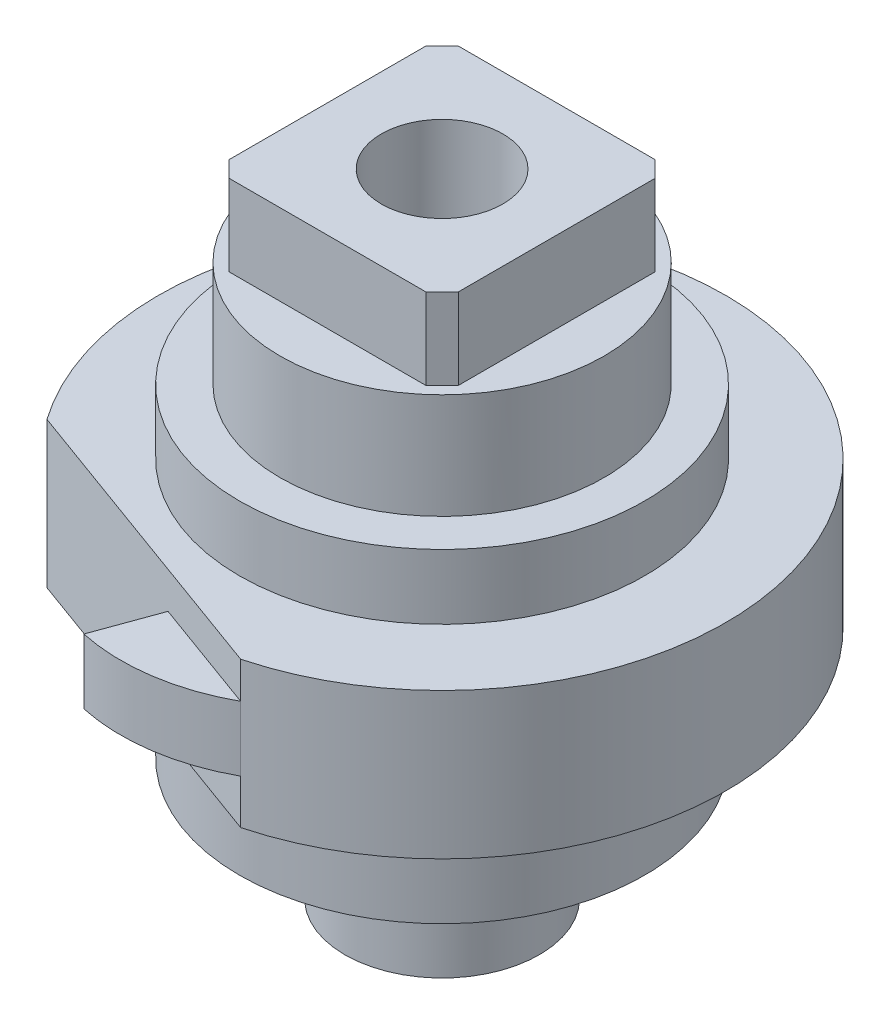
ISO-10303-21;
HEADER;
FILE_DESCRIPTION(('STEP AP214'),'2;1');
FILE_NAME('part.step','',(''),(''),'','','');
FILE_SCHEMA(('AUTOMOTIVE_DESIGN { 1 0 10303 214 1 1 1 1 }'));
ENDSEC;
DATA;
#1=APPLICATION_CONTEXT('core data for automotive mechanical design processes');
#2=APPLICATION_PROTOCOL_DEFINITION('international standard','automotive_design',2000,#1);
#3=PRODUCT_CONTEXT('',#1,'mechanical');
#4=PRODUCT('Part','Part','',(#3));
#5=PRODUCT_RELATED_PRODUCT_CATEGORY('part','',(#4));
#6=PRODUCT_DEFINITION_FORMATION('','',#4);
#7=PRODUCT_DEFINITION_CONTEXT('part definition',#1,'design');
#8=PRODUCT_DEFINITION('design','',#6,#7);
#9=PRODUCT_DEFINITION_SHAPE('','',#8);
#10=(LENGTH_UNIT() NAMED_UNIT(*) SI_UNIT(.MILLI.,.METRE.));
#11=(NAMED_UNIT(*) PLANE_ANGLE_UNIT() SI_UNIT($,.RADIAN.));
#12=(NAMED_UNIT(*) SI_UNIT($,.STERADIAN.) SOLID_ANGLE_UNIT());
#13=UNCERTAINTY_MEASURE_WITH_UNIT(LENGTH_MEASURE(1.E-05),#10,'distance_accuracy_value','');
#14=(GEOMETRIC_REPRESENTATION_CONTEXT(3) GLOBAL_UNCERTAINTY_ASSIGNED_CONTEXT((#13)) GLOBAL_UNIT_ASSIGNED_CONTEXT((#10,
#11,#12)) REPRESENTATION_CONTEXT('',''));
#15=CARTESIAN_POINT('',(0.,0.,0.));
#16=DIRECTION('',(0.,0.,1.));
#17=DIRECTION('',(1.,0.,0.));
#18=AXIS2_PLACEMENT_3D('',#15,#16,#17);
#19=CARTESIAN_POINT('',(0.,0.65,0.));
#20=DIRECTION('',(0.,1.,0.));
#21=DIRECTION('',(0.,0.,1.));
#22=AXIS2_PLACEMENT_3D('',#19,#20,#21);
#23=PLANE('',#22);
#24=CARTESIAN_POINT('',(0.,0.65,0.));
#25=DIRECTION('',(0.,1.,0.));
#26=DIRECTION('',(0.,0.,1.));
#27=AXIS2_PLACEMENT_3D('',#24,#25,#26);
#28=CIRCLE('',#27,1.);
#29=CARTESIAN_POINT('',(-0.707106781186547,0.65,0.707106781186548));
#30=VERTEX_POINT('',#29);
#31=CARTESIAN_POINT('',(0.707106781186548,0.65,0.707106781186547));
#32=VERTEX_POINT('',#31);
#33=EDGE_CURVE('E239',#30,#32,#28,.T.);
#34=ORIENTED_EDGE('',*,*,#33,.T.);
#35=CARTESIAN_POINT('',(0.707106781186548,0.65,-0.707106781186547));
#36=VERTEX_POINT('',#35);
#37=EDGE_CURVE('E252',#32,#36,#28,.T.);
#38=ORIENTED_EDGE('',*,*,#37,.T.);
#39=CARTESIAN_POINT('',(-0.707106781186548,0.65,-0.707106781186547));
#40=VERTEX_POINT('',#39);
#41=EDGE_CURVE('E254',#36,#40,#28,.T.);
#42=ORIENTED_EDGE('',*,*,#41,.T.);
#43=EDGE_CURVE('E593',#40,#30,#28,.T.);
#44=ORIENTED_EDGE('',*,*,#43,.T.);
#45=EDGE_LOOP('',(#34,#38,#42,#44));
#46=FACE_BOUND('',#45,.T.);
#47=DIRECTION('',(1.,0.,0.));
#48=VECTOR('',#47,1.);
#49=CARTESIAN_POINT('',(0.707106781186548,0.65,0.707106781186548));
#50=LINE('',#49,#48);
#51=CARTESIAN_POINT('',(-0.607106781186548,0.65,0.707106781186548));
#52=VERTEX_POINT('',#51);
#53=CARTESIAN_POINT('',(0.607106781186548,0.65,0.707106781186548));
#54=VERTEX_POINT('',#53);
#55=EDGE_CURVE('E47',#52,#54,#50,.T.);
#56=ORIENTED_EDGE('',*,*,#55,.F.);
#57=DIRECTION('',(0.707106781186544,0.,0.707106781186551));
#58=VECTOR('',#57,1.);
#59=CARTESIAN_POINT('',(-0.607106781186548,0.65,0.707106781186548));
#60=LINE('',#59,#58);
#61=CARTESIAN_POINT('',(-0.707106781186547,0.65,0.607106781186548));
#62=VERTEX_POINT('',#61);
#63=EDGE_CURVE('E40',#52,#62,#60,.F.);
#64=ORIENTED_EDGE('',*,*,#63,.T.);
#65=DIRECTION('',(0.,0.,1.));
#66=VECTOR('',#65,1.);
#67=CARTESIAN_POINT('',(-0.707106781186547,0.65,0.707106781186548));
#68=LINE('',#67,#66);
#69=CARTESIAN_POINT('',(-0.707106781186548,0.65,-0.607106781186548));
#70=VERTEX_POINT('',#69);
#71=EDGE_CURVE('E54',#70,#62,#68,.T.);
#72=ORIENTED_EDGE('',*,*,#71,.F.);
#73=DIRECTION('',(-0.707106781186551,0.,0.707106781186544));
#74=VECTOR('',#73,1.);
#75=CARTESIAN_POINT('',(-0.707106781186548,0.65,-0.607106781186548));
#76=LINE('',#75,#74);
#77=CARTESIAN_POINT('',(-0.607106781186547,0.65,-0.707106781186547));
#78=VERTEX_POINT('',#77);
#79=EDGE_CURVE('E215',#70,#78,#76,.F.);
#80=ORIENTED_EDGE('',*,*,#79,.T.);
#81=DIRECTION('',(-1.,0.,0.));
#82=VECTOR('',#81,1.);
#83=CARTESIAN_POINT('',(-0.707106781186548,0.65,-0.707106781186547));
#84=LINE('',#83,#82);
#85=CARTESIAN_POINT('',(0.607106781186549,0.65,-0.707106781186547));
#86=VERTEX_POINT('',#85);
#87=EDGE_CURVE('E248',#86,#78,#84,.T.);
#88=ORIENTED_EDGE('',*,*,#87,.F.);
#89=DIRECTION('',(-0.707106781186541,0.,-0.707106781186554));
#90=VECTOR('',#89,1.);
#91=CARTESIAN_POINT('',(0.607106781186549,0.65,-0.707106781186547));
#92=LINE('',#91,#90);
#93=CARTESIAN_POINT('',(0.707106781186548,0.65,-0.607106781186547));
#94=VERTEX_POINT('',#93);
#95=EDGE_CURVE('E212',#86,#94,#92,.F.);
#96=ORIENTED_EDGE('',*,*,#95,.T.);
#97=DIRECTION('',(0.,0.,-1.));
#98=VECTOR('',#97,1.);
#99=CARTESIAN_POINT('',(0.707106781186548,0.65,-0.707106781186547));
#100=LINE('',#99,#98);
#101=CARTESIAN_POINT('',(0.707106781186548,0.65,0.607106781186549));
#102=VERTEX_POINT('',#101);
#103=EDGE_CURVE('E246',#102,#94,#100,.T.);
#104=ORIENTED_EDGE('',*,*,#103,.F.);
#105=DIRECTION('',(0.707106781186554,0.,-0.707106781186541));
#106=VECTOR('',#105,1.);
#107=CARTESIAN_POINT('',(0.707106781186548,0.65,0.607106781186549));
#108=LINE('',#107,#106);
#109=EDGE_CURVE('E11',#102,#54,#108,.F.);
#110=ORIENTED_EDGE('',*,*,#109,.T.);
#111=EDGE_LOOP('',(#56,#64,#72,#80,#88,#96,#104,#110));
#112=FACE_BOUND('',#111,.T.);
#113=ADVANCED_FACE('F32',(#46,#112),#23,.T.);
#114=CARTESIAN_POINT('',(0.,0.,0.));
#115=DIRECTION('',(0.,1.,0.));
#116=DIRECTION('',(0.,0.,1.));
#117=AXIS2_PLACEMENT_3D('',#114,#115,#116);
#118=PLANE('',#117);
#119=CARTESIAN_POINT('',(0.,0.,0.));
#120=DIRECTION('',(0.,1.,0.));
#121=DIRECTION('',(0.,0.,1.));
#122=AXIS2_PLACEMENT_3D('',#119,#120,#121);
#123=CIRCLE('',#122,1.25);
#124=CARTESIAN_POINT('',(0.,0.,1.25));
#125=VERTEX_POINT('',#124);
#126=EDGE_CURVE('E253',#125,#125,#123,.T.);
#127=ORIENTED_EDGE('',*,*,#126,.T.);
#128=EDGE_LOOP('',(#127));
#129=FACE_BOUND('',#128,.T.);
#130=CARTESIAN_POINT('',(0.,0.,0.));
#131=DIRECTION('',(0.,1.,0.));
#132=DIRECTION('',(0.,0.,1.));
#133=AXIS2_PLACEMENT_3D('',#130,#131,#132);
#134=CIRCLE('',#133,1.);
#135=CARTESIAN_POINT('',(0.,0.,1.));
#136=VERTEX_POINT('',#135);
#137=EDGE_CURVE('E235',#136,#136,#134,.T.);
#138=ORIENTED_EDGE('',*,*,#137,.F.);
#139=EDGE_LOOP('',(#138));
#140=FACE_BOUND('',#139,.T.);
#141=ADVANCED_FACE('F303',(#129,#140),#118,.T.);
#142=CARTESIAN_POINT('',(0.,-0.400000000000004,0.));
#143=DIRECTION('',(0.,-1.,0.));
#144=DIRECTION('',(0.,0.,-1.));
#145=AXIS2_PLACEMENT_3D('',#142,#143,#144);
#146=PLANE('',#145);
#147=CARTESIAN_POINT('',(0.,-0.400000000000004,0.));
#148=DIRECTION('',(0.,-1.,0.));
#149=DIRECTION('',(0.,0.,-1.));
#150=AXIS2_PLACEMENT_3D('',#147,#148,#149);
#151=CIRCLE('',#150,1.75);
#152=CARTESIAN_POINT('',(-1.43088165571397,-0.400000000000004,1.00751063882286));
#153=VERTEX_POINT('',#152);
#154=CARTESIAN_POINT('',(0.44850358585784,-0.400000000000004,1.69155092547421));
#155=VERTEX_POINT('',#154);
#156=EDGE_CURVE('E258',#153,#155,#151,.T.);
#157=ORIENTED_EDGE('',*,*,#156,.F.);
#158=DIRECTION('',(-0.939692620785906,0.,-0.342020143325676));
#159=VECTOR('',#158,1.);
#160=CARTESIAN_POINT('',(0.44850358585784,-0.400000000000004,1.69155092547421));
#161=LINE('',#160,#159);
#162=EDGE_CURVE('E261',#155,#153,#161,.T.);
#163=ORIENTED_EDGE('',*,*,#162,.F.);
#164=EDGE_LOOP('',(#157,#163));
#165=FACE_BOUND('',#164,.T.);
#166=CARTESIAN_POINT('',(0.,-0.400000000000004,0.));
#167=DIRECTION('',(0.,-1.,0.));
#168=DIRECTION('',(0.,0.,-1.));
#169=AXIS2_PLACEMENT_3D('',#166,#167,#168);
#170=CIRCLE('',#169,1.25);
#171=CARTESIAN_POINT('',(0.,-0.400000000000004,-1.25));
#172=VERTEX_POINT('',#171);
#173=EDGE_CURVE('E175',#172,#172,#170,.F.);
#174=ORIENTED_EDGE('',*,*,#173,.F.);
#175=EDGE_LOOP('',(#174));
#176=FACE_BOUND('',#175,.T.);
#177=ADVANCED_FACE('F309',(#165,#176),#146,.F.);
#178=CARTESIAN_POINT('',(0.,-0.400000000000004,0.));
#179=DIRECTION('',(0.,-1.,0.));
#180=DIRECTION('',(0.,0.,-1.));
#181=AXIS2_PLACEMENT_3D('',#178,#179,#180);
#182=CYLINDRICAL_SURFACE('',#181,1.75);
#183=DIRECTION('',(0.,-1.,0.));
#184=VECTOR('',#183,1.);
#185=CARTESIAN_POINT('',(0.44850358585784,-0.625000000000017,1.69155092547421));
#186=LINE('',#185,#184);
#187=CARTESIAN_POINT('',(0.44850358585784,-0.625000000000017,1.69155092547421));
#188=VERTEX_POINT('',#187);
#189=CARTESIAN_POINT('',(0.44850358585784,-1.02500000000002,1.69155092547421));
#190=VERTEX_POINT('',#189);
#191=EDGE_CURVE('E160',#188,#190,#186,.T.);
#192=ORIENTED_EDGE('',*,*,#191,.T.);
#193=DIRECTION('',(0.,1.,0.));
#194=VECTOR('',#193,1.);
#195=CARTESIAN_POINT('',(0.44850358585784,-1.3,1.69155092547421));
#196=LINE('',#195,#194);
#197=CARTESIAN_POINT('',(0.44850358585784,-1.3,1.69155092547421));
#198=VERTEX_POINT('',#197);
#199=EDGE_CURVE('E146',#198,#190,#196,.T.);
#200=ORIENTED_EDGE('',*,*,#199,.F.);
#201=CARTESIAN_POINT('',(0.,-1.3,0.));
#202=DIRECTION('',(0.,-1.,0.));
#203=DIRECTION('',(0.,0.,1.));
#204=AXIS2_PLACEMENT_3D('',#201,#202,#203);
#205=CIRCLE('',#204,1.75);
#206=CARTESIAN_POINT('',(-1.43088165571397,-1.3,1.00751063882286));
#207=VERTEX_POINT('',#206);
#208=EDGE_CURVE('E151',#207,#198,#205,.T.);
#209=ORIENTED_EDGE('',*,*,#208,.F.);
#210=DIRECTION('',(0.,-1.,0.));
#211=VECTOR('',#210,1.);
#212=CARTESIAN_POINT('',(-1.43088165571397,-0.400000000000004,1.00751063882286));
#213=LINE('',#212,#211);
#214=EDGE_CURVE('E148',#153,#207,#213,.T.);
#215=ORIENTED_EDGE('',*,*,#214,.F.);
#216=ORIENTED_EDGE('',*,*,#156,.T.);
#217=DIRECTION('',(0.,-1.,0.));
#218=VECTOR('',#217,1.);
#219=CARTESIAN_POINT('',(0.44850358585784,-0.400000000000004,1.69155092547421));
#220=LINE('',#219,#218);
#221=EDGE_CURVE('E263',#155,#188,#220,.T.);
#222=ORIENTED_EDGE('',*,*,#221,.T.);
#223=EDGE_LOOP('',(#192,#200,#209,#215,#216,#222));
#224=FACE_BOUND('',#223,.T.);
#225=ADVANCED_FACE('F158',(#224),#182,.T.);
#226=CARTESIAN_POINT('',(0.44850358585784,-0.400000000000004,1.69155092547421));
#227=DIRECTION('',(-0.342020143325675,0.,0.939692620785906));
#228=DIRECTION('',(0.939692620785906,0.,0.342020143325676));
#229=AXIS2_PLACEMENT_3D('',#226,#227,#228);
#230=PLANE('',#229);
#231=DIRECTION('',(0.,-1.,0.));
#232=VECTOR('',#231,1.);
#233=CARTESIAN_POINT('',(-0.256265879731589,-0.625000000000017,1.43503581797995));
#234=LINE('',#233,#232);
#235=CARTESIAN_POINT('',(-0.256265879731589,-0.625000000000017,1.43503581797995));
#236=VERTEX_POINT('',#235);
#237=CARTESIAN_POINT('',(-0.256265879731589,-1.02500000000002,1.43503581797995));
#238=VERTEX_POINT('',#237);
#239=EDGE_CURVE('E180',#236,#238,#234,.T.);
#240=ORIENTED_EDGE('',*,*,#239,.F.);
#241=DIRECTION('',(0.939692620785906,0.,0.342020143325676));
#242=VECTOR('',#241,1.);
#243=CARTESIAN_POINT('',(-0.256265879731589,-0.625000000000017,1.43503581797995));
#244=LINE('',#243,#242);
#245=EDGE_CURVE('E268',#236,#188,#244,.T.);
#246=ORIENTED_EDGE('',*,*,#245,.T.);
#247=ORIENTED_EDGE('',*,*,#221,.F.);
#248=ORIENTED_EDGE('',*,*,#162,.T.);
#249=ORIENTED_EDGE('',*,*,#214,.T.);
#250=DIRECTION('',(-0.939692620785906,0.,-0.342020143325676));
#251=VECTOR('',#250,1.);
#252=CARTESIAN_POINT('',(-1.43088165571397,-1.3,1.00751063882286));
#253=LINE('',#252,#251);
#254=EDGE_CURVE('E140',#198,#207,#253,.T.);
#255=ORIENTED_EDGE('',*,*,#254,.F.);
#256=ORIENTED_EDGE('',*,*,#199,.T.);
#257=DIRECTION('',(-0.939692620785906,0.,-0.342020143325676));
#258=VECTOR('',#257,1.);
#259=CARTESIAN_POINT('',(-1.43088165571397,-1.02500000000002,1.00751063882286));
#260=LINE('',#259,#258);
#261=EDGE_CURVE('E155',#190,#238,#260,.T.);
#262=ORIENTED_EDGE('',*,*,#261,.T.);
#263=EDGE_LOOP('',(#240,#246,#247,#248,#249,#255,#256,#262));
#264=FACE_BOUND('',#263,.T.);
#265=ADVANCED_FACE('F143',(#264),#230,.T.);
#266=CARTESIAN_POINT('',(0.,-1.02500000000002,0.));
#267=DIRECTION('',(0.,-1.,0.));
#268=DIRECTION('',(0.,0.,-1.));
#269=AXIS2_PLACEMENT_3D('',#266,#267,#268);
#270=PLANE('',#269);
#271=ORIENTED_EDGE('',*,*,#261,.F.);
#272=CARTESIAN_POINT('',(-0.140067423164718,-1.02500000000002,0.622643950180501));
#273=DIRECTION('',(0.,-1.,0.));
#274=DIRECTION('',(0.,0.,-1.));
#275=AXIS2_PLACEMENT_3D('',#272,#273,#274);
#276=CIRCLE('',#275,1.22023684360594);
#277=CARTESIAN_POINT('',(-0.394915123508788,-1.02500000000002,1.81597148448226));
#278=VERTEX_POINT('',#277);
#279=EDGE_CURVE('E161',#190,#278,#276,.T.);
#280=ORIENTED_EDGE('',*,*,#279,.T.);
#281=DIRECTION('',(0.342020143325675,0.,-0.939692620785906));
#282=VECTOR('',#281,1.);
#283=CARTESIAN_POINT('',(-0.394915123508788,-1.02500000000002,1.81597148448226));
#284=LINE('',#283,#282);
#285=EDGE_CURVE('E164',#278,#238,#284,.T.);
#286=ORIENTED_EDGE('',*,*,#285,.T.);
#287=EDGE_LOOP('',(#271,#280,#286));
#288=FACE_BOUND('',#287,.T.);
#289=ADVANCED_FACE('F323',(#288),#270,.T.);
#290=CARTESIAN_POINT('',(0.,0.,0.));
#291=DIRECTION('',(0.,-1.,0.));
#292=DIRECTION('',(0.,0.,-1.));
#293=AXIS2_PLACEMENT_3D('',#290,#291,#292);
#294=CYLINDRICAL_SURFACE('',#293,1.25);
#295=ORIENTED_EDGE('',*,*,#126,.F.);
#296=EDGE_LOOP('',(#295));
#297=FACE_BOUND('',#296,.T.);
#298=ORIENTED_EDGE('',*,*,#173,.T.);
#299=EDGE_LOOP('',(#298));
#300=FACE_BOUND('',#299,.T.);
#301=ADVANCED_FACE('F318',(#297,#300),#294,.T.);
#302=CARTESIAN_POINT('',(0.,0.65,0.));
#303=DIRECTION('',(0.,-1.,0.));
#304=DIRECTION('',(0.,0.,-1.));
#305=AXIS2_PLACEMENT_3D('',#302,#303,#304);
#306=CYLINDRICAL_SURFACE('',#305,1.);
#307=ORIENTED_EDGE('',*,*,#37,.F.);
#308=ORIENTED_EDGE('',*,*,#33,.F.);
#309=ORIENTED_EDGE('',*,*,#43,.F.);
#310=ORIENTED_EDGE('',*,*,#41,.F.);
#311=EDGE_LOOP('',(#307,#308,#309,#310));
#312=FACE_BOUND('',#311,.T.);
#313=ORIENTED_EDGE('',*,*,#137,.T.);
#314=EDGE_LOOP('',(#313));
#315=FACE_BOUND('',#314,.T.);
#316=ADVANCED_FACE('F316',(#312,#315),#306,.T.);
#317=CARTESIAN_POINT('',(0.707106781186548,1.15,0.707106781186548));
#318=DIRECTION('',(0.,0.,-1.));
#319=DIRECTION('',(-1.,0.,0.));
#320=AXIS2_PLACEMENT_3D('',#317,#318,#319);
#321=PLANE('',#320);
#322=DIRECTION('',(1.,0.,0.));
#323=VECTOR('',#322,1.);
#324=CARTESIAN_POINT('',(0.707106781186548,1.15,0.707106781186548));
#325=LINE('',#324,#323);
#326=CARTESIAN_POINT('',(-0.607106781186548,1.15,0.707106781186548));
#327=VERTEX_POINT('',#326);
#328=CARTESIAN_POINT('',(0.607106781186548,1.15,0.707106781186548));
#329=VERTEX_POINT('',#328);
#330=EDGE_CURVE('E251',#327,#329,#325,.T.);
#331=ORIENTED_EDGE('',*,*,#330,.F.);
#332=DIRECTION('',(0.,-1.,0.));
#333=VECTOR('',#332,1.);
#334=CARTESIAN_POINT('',(-0.607106781186548,1.15,0.707106781186548));
#335=LINE('',#334,#333);
#336=EDGE_CURVE('E210',#327,#52,#335,.T.);
#337=ORIENTED_EDGE('',*,*,#336,.T.);
#338=ORIENTED_EDGE('',*,*,#55,.T.);
#339=DIRECTION('',(0.,1.,0.));
#340=VECTOR('',#339,1.);
#341=CARTESIAN_POINT('',(0.607106781186548,1.15,0.707106781186548));
#342=LINE('',#341,#340);
#343=EDGE_CURVE('E208',#54,#329,#342,.T.);
#344=ORIENTED_EDGE('',*,*,#343,.T.);
#345=EDGE_LOOP('',(#331,#337,#338,#344));
#346=FACE_BOUND('',#345,.T.);
#347=ADVANCED_FACE('F314',(#346),#321,.F.);
#348=CARTESIAN_POINT('',(0.707106781186548,1.15,-0.707106781186547));
#349=DIRECTION('',(-1.,0.,0.));
#350=DIRECTION('',(0.,0.,1.));
#351=AXIS2_PLACEMENT_3D('',#348,#349,#350);
#352=PLANE('',#351);
#353=ORIENTED_EDGE('',*,*,#103,.T.);
#354=DIRECTION('',(0.,1.,0.));
#355=VECTOR('',#354,1.);
#356=CARTESIAN_POINT('',(0.707106781186548,1.15,-0.607106781186547));
#357=LINE('',#356,#355);
#358=CARTESIAN_POINT('',(0.707106781186548,1.15,-0.607106781186547));
#359=VERTEX_POINT('',#358);
#360=EDGE_CURVE('E194',#94,#359,#357,.T.);
#361=ORIENTED_EDGE('',*,*,#360,.T.);
#362=DIRECTION('',(0.,0.,-1.));
#363=VECTOR('',#362,1.);
#364=CARTESIAN_POINT('',(0.707106781186548,1.15,-0.707106781186547));
#365=LINE('',#364,#363);
#366=CARTESIAN_POINT('',(0.707106781186548,1.15,0.607106781186549));
#367=VERTEX_POINT('',#366);
#368=EDGE_CURVE('E241',#367,#359,#365,.T.);
#369=ORIENTED_EDGE('',*,*,#368,.F.);
#370=DIRECTION('',(0.,-1.,0.));
#371=VECTOR('',#370,1.);
#372=CARTESIAN_POINT('',(0.707106781186548,1.15,0.607106781186549));
#373=LINE('',#372,#371);
#374=EDGE_CURVE('E191',#367,#102,#373,.T.);
#375=ORIENTED_EDGE('',*,*,#374,.T.);
#376=EDGE_LOOP('',(#353,#361,#369,#375));
#377=FACE_BOUND('',#376,.T.);
#378=ADVANCED_FACE('F363',(#377),#352,.F.);
#379=CARTESIAN_POINT('',(-0.707106781186548,1.15,-0.707106781186547));
#380=DIRECTION('',(0.,0.,1.));
#381=DIRECTION('',(1.,0.,0.));
#382=AXIS2_PLACEMENT_3D('',#379,#380,#381);
#383=PLANE('',#382);
#384=DIRECTION('',(-1.,0.,0.));
#385=VECTOR('',#384,1.);
#386=CARTESIAN_POINT('',(-0.707106781186548,1.15,-0.707106781186547));
#387=LINE('',#386,#385);
#388=CARTESIAN_POINT('',(0.607106781186549,1.15,-0.707106781186547));
#389=VERTEX_POINT('',#388);
#390=CARTESIAN_POINT('',(-0.607106781186547,1.15,-0.707106781186547));
#391=VERTEX_POINT('',#390);
#392=EDGE_CURVE('E236',#389,#391,#387,.T.);
#393=ORIENTED_EDGE('',*,*,#392,.F.);
#394=DIRECTION('',(0.,-1.,0.));
#395=VECTOR('',#394,1.);
#396=CARTESIAN_POINT('',(0.607106781186549,1.15,-0.707106781186547));
#397=LINE('',#396,#395);
#398=EDGE_CURVE('E188',#389,#86,#397,.T.);
#399=ORIENTED_EDGE('',*,*,#398,.T.);
#400=ORIENTED_EDGE('',*,*,#87,.T.);
#401=DIRECTION('',(0.,1.,0.));
#402=VECTOR('',#401,1.);
#403=CARTESIAN_POINT('',(-0.607106781186547,1.15,-0.707106781186547));
#404=LINE('',#403,#402);
#405=EDGE_CURVE('E186',#78,#391,#404,.T.);
#406=ORIENTED_EDGE('',*,*,#405,.T.);
#407=EDGE_LOOP('',(#393,#399,#400,#406));
#408=FACE_BOUND('',#407,.T.);
#409=ADVANCED_FACE('F289',(#408),#383,.F.);
#410=CARTESIAN_POINT('',(-0.707106781186547,1.15,0.707106781186548));
#411=DIRECTION('',(1.,0.,0.));
#412=DIRECTION('',(0.,0.,-1.));
#413=AXIS2_PLACEMENT_3D('',#410,#411,#412);
#414=PLANE('',#413);
#415=DIRECTION('',(0.,0.,1.));
#416=VECTOR('',#415,1.);
#417=CARTESIAN_POINT('',(-0.707106781186547,1.15,0.707106781186548));
#418=LINE('',#417,#416);
#419=CARTESIAN_POINT('',(-0.707106781186548,1.15,-0.607106781186548));
#420=VERTEX_POINT('',#419);
#421=CARTESIAN_POINT('',(-0.707106781186547,1.15,0.607106781186548));
#422=VERTEX_POINT('',#421);
#423=EDGE_CURVE('E226',#420,#422,#418,.T.);
#424=ORIENTED_EDGE('',*,*,#423,.F.);
#425=DIRECTION('',(0.,-1.,0.));
#426=VECTOR('',#425,1.);
#427=CARTESIAN_POINT('',(-0.707106781186548,1.15,-0.607106781186548));
#428=LINE('',#427,#426);
#429=EDGE_CURVE('E206',#420,#70,#428,.T.);
#430=ORIENTED_EDGE('',*,*,#429,.T.);
#431=ORIENTED_EDGE('',*,*,#71,.T.);
#432=DIRECTION('',(0.,1.,0.));
#433=VECTOR('',#432,1.);
#434=CARTESIAN_POINT('',(-0.707106781186547,1.15,0.607106781186548));
#435=LINE('',#434,#433);
#436=EDGE_CURVE('E204',#62,#422,#435,.T.);
#437=ORIENTED_EDGE('',*,*,#436,.T.);
#438=EDGE_LOOP('',(#424,#430,#431,#437));
#439=FACE_BOUND('',#438,.T.);
#440=ADVANCED_FACE('F225',(#439),#414,.F.);
#441=CARTESIAN_POINT('',(0.,1.15,0.));
#442=DIRECTION('',(0.,-1.,0.));
#443=DIRECTION('',(0.,0.,-1.));
#444=AXIS2_PLACEMENT_3D('',#441,#442,#443);
#445=PLANE('',#444);
#446=CARTESIAN_POINT('',(0.,1.15,0.));
#447=DIRECTION('',(0.,1.,0.));
#448=DIRECTION('',(0.,0.,1.));
#449=AXIS2_PLACEMENT_3D('',#446,#447,#448);
#450=CIRCLE('',#449,0.375000000000014);
#451=CARTESIAN_POINT('',(0.,1.15,0.375000000000014));
#452=VERTEX_POINT('',#451);
#453=EDGE_CURVE('E557',#452,#452,#450,.T.);
#454=ORIENTED_EDGE('',*,*,#453,.F.);
#455=EDGE_LOOP('',(#454));
#456=FACE_BOUND('',#455,.T.);
#457=ORIENTED_EDGE('',*,*,#368,.T.);
#458=DIRECTION('',(0.707106781186541,0.,0.707106781186554));
#459=VECTOR('',#458,1.);
#460=CARTESIAN_POINT('',(0.607106781186549,1.15,-0.707106781186547));
#461=LINE('',#460,#459);
#462=EDGE_CURVE('E202',#359,#389,#461,.F.);
#463=ORIENTED_EDGE('',*,*,#462,.T.);
#464=ORIENTED_EDGE('',*,*,#392,.T.);
#465=DIRECTION('',(0.707106781186551,0.,-0.707106781186544));
#466=VECTOR('',#465,1.);
#467=CARTESIAN_POINT('',(-0.707106781186548,1.15,-0.607106781186548));
#468=LINE('',#467,#466);
#469=EDGE_CURVE('E200',#391,#420,#468,.F.);
#470=ORIENTED_EDGE('',*,*,#469,.T.);
#471=ORIENTED_EDGE('',*,*,#423,.T.);
#472=DIRECTION('',(-0.707106781186544,0.,-0.707106781186551));
#473=VECTOR('',#472,1.);
#474=CARTESIAN_POINT('',(-0.607106781186548,1.15,0.707106781186548));
#475=LINE('',#474,#473);
#476=EDGE_CURVE('E198',#422,#327,#475,.F.);
#477=ORIENTED_EDGE('',*,*,#476,.T.);
#478=ORIENTED_EDGE('',*,*,#330,.T.);
#479=DIRECTION('',(-0.707106781186554,0.,0.707106781186541));
#480=VECTOR('',#479,1.);
#481=CARTESIAN_POINT('',(0.707106781186548,1.15,0.607106781186549));
#482=LINE('',#481,#480);
#483=EDGE_CURVE('E196',#329,#367,#482,.F.);
#484=ORIENTED_EDGE('',*,*,#483,.T.);
#485=EDGE_LOOP('',(#457,#463,#464,#470,#471,#477,#478,#484));
#486=FACE_BOUND('',#485,.T.);
#487=ADVANCED_FACE('F230',(#456,#486),#445,.F.);
#488=CARTESIAN_POINT('',(-0.140067423164718,-0.625000000000017,0.622643950180501));
#489=DIRECTION('',(0.,-1.,0.));
#490=DIRECTION('',(0.,0.,-1.));
#491=AXIS2_PLACEMENT_3D('',#488,#489,#490);
#492=CYLINDRICAL_SURFACE('',#491,1.22023684360594);
#493=ORIENTED_EDGE('',*,*,#279,.F.);
#494=ORIENTED_EDGE('',*,*,#191,.F.);
#495=CARTESIAN_POINT('',(-0.140067423164718,-0.625000000000017,0.622643950180501));
#496=DIRECTION('',(0.,-1.,0.));
#497=DIRECTION('',(0.,0.,-1.));
#498=AXIS2_PLACEMENT_3D('',#495,#496,#497);
#499=CIRCLE('',#498,1.22023684360594);
#500=CARTESIAN_POINT('',(-0.394915123508788,-0.625000000000017,1.81597148448226));
#501=VERTEX_POINT('',#500);
#502=EDGE_CURVE('E170',#188,#501,#499,.T.);
#503=ORIENTED_EDGE('',*,*,#502,.T.);
#504=DIRECTION('',(0.,-1.,0.));
#505=VECTOR('',#504,1.);
#506=CARTESIAN_POINT('',(-0.394915123508788,-0.625000000000017,1.81597148448226));
#507=LINE('',#506,#505);
#508=EDGE_CURVE('E183',#501,#278,#507,.T.);
#509=ORIENTED_EDGE('',*,*,#508,.T.);
#510=EDGE_LOOP('',(#493,#494,#503,#509));
#511=FACE_BOUND('',#510,.T.);
#512=ADVANCED_FACE('F386',(#511),#492,.T.);
#513=CARTESIAN_POINT('',(-0.394915123508788,-0.625000000000017,1.81597148448226));
#514=DIRECTION('',(-0.939692620785906,0.,-0.342020143325675));
#515=DIRECTION('',(-0.342020143325675,0.,0.939692620785906));
#516=AXIS2_PLACEMENT_3D('',#513,#514,#515);
#517=PLANE('',#516);
#518=ORIENTED_EDGE('',*,*,#285,.F.);
#519=ORIENTED_EDGE('',*,*,#508,.F.);
#520=DIRECTION('',(0.342020143325675,0.,-0.939692620785906));
#521=VECTOR('',#520,1.);
#522=CARTESIAN_POINT('',(-0.394915123508788,-0.625000000000017,1.81597148448226));
#523=LINE('',#522,#521);
#524=EDGE_CURVE('E272',#501,#236,#523,.T.);
#525=ORIENTED_EDGE('',*,*,#524,.T.);
#526=ORIENTED_EDGE('',*,*,#239,.T.);
#527=EDGE_LOOP('',(#518,#519,#525,#526));
#528=FACE_BOUND('',#527,.T.);
#529=ADVANCED_FACE('F394',(#528),#517,.T.);
#530=CARTESIAN_POINT('',(-0.140067423164718,-0.625000000000017,0.622643950180501));
#531=DIRECTION('',(0.,-1.,0.));
#532=DIRECTION('',(0.,0.,-1.));
#533=AXIS2_PLACEMENT_3D('',#530,#531,#532);
#534=PLANE('',#533);
#535=ORIENTED_EDGE('',*,*,#502,.F.);
#536=ORIENTED_EDGE('',*,*,#245,.F.);
#537=ORIENTED_EDGE('',*,*,#524,.F.);
#538=EDGE_LOOP('',(#535,#536,#537));
#539=FACE_BOUND('',#538,.T.);
#540=ADVANCED_FACE('F402',(#539),#534,.F.);
#541=CARTESIAN_POINT('',(0.,-1.3,0.));
#542=DIRECTION('',(0.,1.,0.));
#543=DIRECTION('',(0.,0.,1.));
#544=AXIS2_PLACEMENT_3D('',#541,#542,#543);
#545=PLANE('',#544);
#546=CARTESIAN_POINT('',(0.,-1.3,0.));
#547=DIRECTION('',(0.,1.,0.));
#548=DIRECTION('',(0.,0.,1.));
#549=AXIS2_PLACEMENT_3D('',#546,#547,#548);
#550=CIRCLE('',#549,1.25);
#551=CARTESIAN_POINT('',(0.,-1.3,1.25));
#552=VERTEX_POINT('',#551);
#553=EDGE_CURVE('E567',#552,#552,#550,.T.);
#554=ORIENTED_EDGE('',*,*,#553,.T.);
#555=EDGE_LOOP('',(#554));
#556=FACE_BOUND('',#555,.T.);
#557=ORIENTED_EDGE('',*,*,#208,.T.);
#558=ORIENTED_EDGE('',*,*,#254,.T.);
#559=EDGE_LOOP('',(#557,#558));
#560=FACE_BOUND('',#559,.T.);
#561=ADVANCED_FACE('F153',(#556,#560),#545,.F.);
#562=CARTESIAN_POINT('',(0.,-2.75,0.));
#563=DIRECTION('',(0.,1.,0.));
#564=DIRECTION('',(0.,0.,1.));
#565=AXIS2_PLACEMENT_3D('',#562,#563,#564);
#566=CYLINDRICAL_SURFACE('',#565,0.6);
#567=CARTESIAN_POINT('',(0.,-2.75,0.));
#568=DIRECTION('',(0.,1.,0.));
#569=DIRECTION('',(0.,0.,1.));
#570=AXIS2_PLACEMENT_3D('',#567,#568,#569);
#571=CIRCLE('',#570,0.6);
#572=CARTESIAN_POINT('',(0.,-2.75,0.6));
#573=VERTEX_POINT('',#572);
#574=EDGE_CURVE('E169',#573,#573,#571,.T.);
#575=ORIENTED_EDGE('',*,*,#574,.T.);
#576=EDGE_LOOP('',(#575));
#577=FACE_BOUND('',#576,.T.);
#578=CARTESIAN_POINT('',(0.,-2.,0.));
#579=DIRECTION('',(0.,1.,0.));
#580=DIRECTION('',(0.,0.,1.));
#581=AXIS2_PLACEMENT_3D('',#578,#579,#580);
#582=CIRCLE('',#581,0.6);
#583=CARTESIAN_POINT('',(0.,-2.,0.6));
#584=VERTEX_POINT('',#583);
#585=EDGE_CURVE('E559',#584,#584,#582,.T.);
#586=ORIENTED_EDGE('',*,*,#585,.F.);
#587=EDGE_LOOP('',(#586));
#588=FACE_BOUND('',#587,.T.);
#589=ADVANCED_FACE('F415',(#577,#588),#566,.T.);
#590=CARTESIAN_POINT('',(0.6,-2.75,0.));
#591=DIRECTION('',(0.,-1.,0.));
#592=DIRECTION('',(0.,0.,-1.));
#593=AXIS2_PLACEMENT_3D('',#590,#591,#592);
#594=PLANE('',#593);
#595=ORIENTED_EDGE('',*,*,#574,.F.);
#596=EDGE_LOOP('',(#595));
#597=FACE_BOUND('',#596,.T.);
#598=ADVANCED_FACE('F423',(#597),#594,.T.);
#599=CARTESIAN_POINT('',(0.,-2.75,0.));
#600=DIRECTION('',(0.,1.,0.));
#601=DIRECTION('',(0.,0.,1.));
#602=AXIS2_PLACEMENT_3D('',#599,#600,#601);
#603=CYLINDRICAL_SURFACE('',#602,1.25);
#604=CARTESIAN_POINT('',(0.,-2.,0.));
#605=DIRECTION('',(0.,1.,0.));
#606=DIRECTION('',(0.,0.,1.));
#607=AXIS2_PLACEMENT_3D('',#604,#605,#606);
#608=CIRCLE('',#607,1.25);
#609=CARTESIAN_POINT('',(0.,-2.,1.25));
#610=VERTEX_POINT('',#609);
#611=EDGE_CURVE('E564',#610,#610,#608,.T.);
#612=ORIENTED_EDGE('',*,*,#611,.T.);
#613=EDGE_LOOP('',(#612));
#614=FACE_BOUND('',#613,.T.);
#615=ORIENTED_EDGE('',*,*,#553,.F.);
#616=EDGE_LOOP('',(#615));
#617=FACE_BOUND('',#616,.T.);
#618=ADVANCED_FACE('F431',(#614,#617),#603,.T.);
#619=CARTESIAN_POINT('',(1.25,-2.,0.));
#620=DIRECTION('',(0.,-1.,0.));
#621=DIRECTION('',(0.,0.,-1.));
#622=AXIS2_PLACEMENT_3D('',#619,#620,#621);
#623=PLANE('',#622);
#624=ORIENTED_EDGE('',*,*,#585,.T.);
#625=EDGE_LOOP('',(#624));
#626=FACE_BOUND('',#625,.T.);
#627=ORIENTED_EDGE('',*,*,#611,.F.);
#628=EDGE_LOOP('',(#627));
#629=FACE_BOUND('',#628,.T.);
#630=ADVANCED_FACE('F439',(#626,#629),#623,.T.);
#631=CARTESIAN_POINT('',(0.,-0.850000000000002,0.));
#632=DIRECTION('',(0.,-1.,0.));
#633=DIRECTION('',(0.,0.,-1.));
#634=AXIS2_PLACEMENT_3D('',#631,#632,#633);
#635=PLANE('',#634);
#636=CARTESIAN_POINT('',(0.,-0.850000000000002,0.));
#637=DIRECTION('',(0.,1.,0.));
#638=DIRECTION('',(0.,0.,1.));
#639=AXIS2_PLACEMENT_3D('',#636,#637,#638);
#640=CIRCLE('',#639,0.375000000000014);
#641=CARTESIAN_POINT('',(0.,-0.850000000000002,0.375000000000014));
#642=VERTEX_POINT('',#641);
#643=EDGE_CURVE('E554',#642,#642,#640,.T.);
#644=ORIENTED_EDGE('',*,*,#643,.T.);
#645=EDGE_LOOP('',(#644));
#646=FACE_BOUND('',#645,.T.);
#647=ADVANCED_FACE('F447',(#646),#635,.F.);
#648=CARTESIAN_POINT('',(0.,1.15,0.));
#649=DIRECTION('',(0.,1.,0.));
#650=DIRECTION('',(0.,0.,1.));
#651=AXIS2_PLACEMENT_3D('',#648,#649,#650);
#652=CYLINDRICAL_SURFACE('',#651,0.375000000000014);
#653=ORIENTED_EDGE('',*,*,#643,.F.);
#654=EDGE_LOOP('',(#653));
#655=FACE_BOUND('',#654,.T.);
#656=ORIENTED_EDGE('',*,*,#453,.T.);
#657=EDGE_LOOP('',(#656));
#658=FACE_BOUND('',#657,.T.);
#659=ADVANCED_FACE('F300',(#655,#658),#652,.F.);
#660=CARTESIAN_POINT('',(0.607106781186549,1.15,-0.707106781186547));
#661=DIRECTION('',(-0.707106781186554,0.,0.707106781186541));
#662=DIRECTION('',(0.,-1.,0.));
#663=AXIS2_PLACEMENT_3D('',#660,#661,#662);
#664=PLANE('',#663);
#665=ORIENTED_EDGE('',*,*,#462,.F.);
#666=ORIENTED_EDGE('',*,*,#360,.F.);
#667=ORIENTED_EDGE('',*,*,#95,.F.);
#668=ORIENTED_EDGE('',*,*,#398,.F.);
#669=EDGE_LOOP('',(#665,#666,#667,#668));
#670=FACE_BOUND('',#669,.T.);
#671=ADVANCED_FACE('F286',(#670),#664,.F.);
#672=CARTESIAN_POINT('',(-0.707106781186548,1.15,-0.607106781186548));
#673=DIRECTION('',(0.707106781186544,0.,0.707106781186551));
#674=DIRECTION('',(0.,-1.,0.));
#675=AXIS2_PLACEMENT_3D('',#672,#673,#674);
#676=PLANE('',#675);
#677=ORIENTED_EDGE('',*,*,#469,.F.);
#678=ORIENTED_EDGE('',*,*,#405,.F.);
#679=ORIENTED_EDGE('',*,*,#79,.F.);
#680=ORIENTED_EDGE('',*,*,#429,.F.);
#681=EDGE_LOOP('',(#677,#678,#679,#680));
#682=FACE_BOUND('',#681,.T.);
#683=ADVANCED_FACE('F293',(#682),#676,.F.);
#684=CARTESIAN_POINT('',(-0.607106781186548,1.15,0.707106781186548));
#685=DIRECTION('',(0.707106781186551,0.,-0.707106781186544));
#686=DIRECTION('',(0.,-1.,0.));
#687=AXIS2_PLACEMENT_3D('',#684,#685,#686);
#688=PLANE('',#687);
#689=ORIENTED_EDGE('',*,*,#476,.F.);
#690=ORIENTED_EDGE('',*,*,#436,.F.);
#691=ORIENTED_EDGE('',*,*,#63,.F.);
#692=ORIENTED_EDGE('',*,*,#336,.F.);
#693=EDGE_LOOP('',(#689,#690,#691,#692));
#694=FACE_BOUND('',#693,.T.);
#695=ADVANCED_FACE('F222',(#694),#688,.F.);
#696=CARTESIAN_POINT('',(0.707106781186548,1.15,0.607106781186549));
#697=DIRECTION('',(-0.707106781186541,0.,-0.707106781186554));
#698=DIRECTION('',(0.,-1.,0.));
#699=AXIS2_PLACEMENT_3D('',#696,#697,#698);
#700=PLANE('',#699);
#701=ORIENTED_EDGE('',*,*,#483,.F.);
#702=ORIENTED_EDGE('',*,*,#343,.F.);
#703=ORIENTED_EDGE('',*,*,#109,.F.);
#704=ORIENTED_EDGE('',*,*,#374,.F.);
#705=EDGE_LOOP('',(#701,#702,#703,#704));
#706=FACE_BOUND('',#705,.T.);
#707=ADVANCED_FACE('F34',(#706),#700,.F.);
#708=CLOSED_SHELL('',(#113,#141,#177,#225,#265,#289,#301,#316,#347,#378,#409,#440,#487,#512,
#529,#540,#561,#589,#598,#618,#630,#647,#659,#671,#683,#695,#707));
#709=MANIFOLD_SOLID_BREP('B2',#708);
#710=ADVANCED_BREP_SHAPE_REPRESENTATION('',(#18,#709),#14);
#711=SHAPE_DEFINITION_REPRESENTATION(#9,#710);
ENDSEC;
END-ISO-10303-21;
